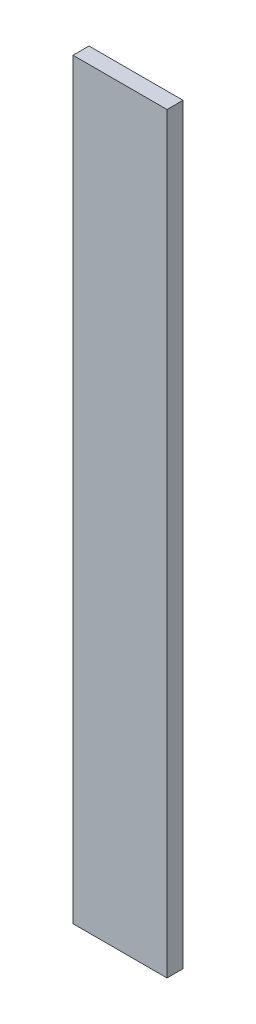
ISO-10303-21;
HEADER;
FILE_DESCRIPTION(('STEP AP214'),'2;1');
FILE_NAME('part.step','',(''),(''),'','','');
FILE_SCHEMA(('AUTOMOTIVE_DESIGN { 1 0 10303 214 1 1 1 1 }'));
ENDSEC;
DATA;
#1=APPLICATION_CONTEXT('core data for automotive mechanical design processes');
#2=APPLICATION_PROTOCOL_DEFINITION('international standard','automotive_design',2000,#1);
#3=PRODUCT_CONTEXT('',#1,'mechanical');
#4=PRODUCT('Part','Part','',(#3));
#5=PRODUCT_RELATED_PRODUCT_CATEGORY('part','',(#4));
#6=PRODUCT_DEFINITION_FORMATION('','',#4);
#7=PRODUCT_DEFINITION_CONTEXT('part definition',#1,'design');
#8=PRODUCT_DEFINITION('design','',#6,#7);
#9=PRODUCT_DEFINITION_SHAPE('','',#8);
#10=(LENGTH_UNIT() NAMED_UNIT(*) SI_UNIT(.MILLI.,.METRE.));
#11=(NAMED_UNIT(*) PLANE_ANGLE_UNIT() SI_UNIT($,.RADIAN.));
#12=(NAMED_UNIT(*) SI_UNIT($,.STERADIAN.) SOLID_ANGLE_UNIT());
#13=UNCERTAINTY_MEASURE_WITH_UNIT(LENGTH_MEASURE(1.E-05),#10,'distance_accuracy_value','');
#14=(GEOMETRIC_REPRESENTATION_CONTEXT(3) GLOBAL_UNCERTAINTY_ASSIGNED_CONTEXT((#13)) GLOBAL_UNIT_ASSIGNED_CONTEXT((#10,
#11,#12)) REPRESENTATION_CONTEXT('',''));
#15=CARTESIAN_POINT('',(0.,0.,0.));
#16=DIRECTION('',(0.,0.,1.));
#17=DIRECTION('',(1.,0.,0.));
#18=AXIS2_PLACEMENT_3D('',#15,#16,#17);
#19=CARTESIAN_POINT('',(1.27,10.16,0.4318));
#20=DIRECTION('',(0.,0.,-1.));
#21=DIRECTION('',(-1.,0.,0.));
#22=AXIS2_PLACEMENT_3D('',#19,#20,#21);
#23=PLANE('',#22);
#24=DIRECTION('',(0.,1.,0.));
#25=VECTOR('',#24,1.);
#26=CARTESIAN_POINT('',(-1.27,10.16,0.4318));
#27=LINE('',#26,#25);
#28=CARTESIAN_POINT('',(-1.27,10.16,0.4318));
#29=VERTEX_POINT('',#28);
#30=CARTESIAN_POINT('',(-1.27,-10.16,0.4318));
#31=VERTEX_POINT('',#30);
#32=EDGE_CURVE('E55',#29,#31,#27,.F.);
#33=ORIENTED_EDGE('',*,*,#32,.T.);
#34=DIRECTION('',(1.,0.,0.));
#35=VECTOR('',#34,1.);
#36=CARTESIAN_POINT('',(-1.27,-10.16,0.4318));
#37=LINE('',#36,#35);
#38=CARTESIAN_POINT('',(1.27,-10.16,0.4318));
#39=VERTEX_POINT('',#38);
#40=EDGE_CURVE('E57',#31,#39,#37,.T.);
#41=ORIENTED_EDGE('',*,*,#40,.T.);
#42=DIRECTION('',(0.,1.,0.));
#43=VECTOR('',#42,1.);
#44=CARTESIAN_POINT('',(1.27,-10.16,0.4318));
#45=LINE('',#44,#43);
#46=CARTESIAN_POINT('',(1.27,10.16,0.4318));
#47=VERTEX_POINT('',#46);
#48=EDGE_CURVE('E20',#39,#47,#45,.T.);
#49=ORIENTED_EDGE('',*,*,#48,.T.);
#50=DIRECTION('',(1.,0.,0.));
#51=VECTOR('',#50,1.);
#52=CARTESIAN_POINT('',(1.27,10.16,0.4318));
#53=LINE('',#52,#51);
#54=EDGE_CURVE('E80',#47,#29,#53,.F.);
#55=ORIENTED_EDGE('',*,*,#54,.T.);
#56=EDGE_LOOP('',(#33,#41,#49,#55));
#57=FACE_BOUND('',#56,.T.);
#58=ADVANCED_FACE('F17',(#57),#23,.F.);
#59=CARTESIAN_POINT('',(1.27,-10.16,0.));
#60=DIRECTION('',(-1.,0.,0.));
#61=DIRECTION('',(0.,0.,1.));
#62=AXIS2_PLACEMENT_3D('',#59,#60,#61);
#63=PLANE('',#62);
#64=DIRECTION('',(0.,0.,-1.));
#65=VECTOR('',#64,1.);
#66=CARTESIAN_POINT('',(1.27,10.16,0.));
#67=LINE('',#66,#65);
#68=CARTESIAN_POINT('',(1.27,10.16,0.));
#69=VERTEX_POINT('',#68);
#70=EDGE_CURVE('E68',#69,#47,#67,.F.);
#71=ORIENTED_EDGE('',*,*,#70,.T.);
#72=ORIENTED_EDGE('',*,*,#48,.F.);
#73=DIRECTION('',(0.,0.,1.));
#74=VECTOR('',#73,1.);
#75=CARTESIAN_POINT('',(1.27,-10.16,0.));
#76=LINE('',#75,#74);
#77=CARTESIAN_POINT('',(1.27,-10.16,0.));
#78=VERTEX_POINT('',#77);
#79=EDGE_CURVE('E63',#39,#78,#76,.F.);
#80=ORIENTED_EDGE('',*,*,#79,.T.);
#81=DIRECTION('',(0.,1.,0.));
#82=VECTOR('',#81,1.);
#83=CARTESIAN_POINT('',(1.27,10.16,0.));
#84=LINE('',#83,#82);
#85=EDGE_CURVE('E83',#69,#78,#84,.F.);
#86=ORIENTED_EDGE('',*,*,#85,.F.);
#87=EDGE_LOOP('',(#71,#72,#80,#86));
#88=FACE_BOUND('',#87,.T.);
#89=ADVANCED_FACE('F65',(#88),#63,.F.);
#90=CARTESIAN_POINT('',(-1.27,-10.16,0.));
#91=DIRECTION('',(0.,1.,0.));
#92=DIRECTION('',(0.,0.,1.));
#93=AXIS2_PLACEMENT_3D('',#90,#91,#92);
#94=PLANE('',#93);
#95=ORIENTED_EDGE('',*,*,#79,.F.);
#96=ORIENTED_EDGE('',*,*,#40,.F.);
#97=DIRECTION('',(0.,0.,-1.));
#98=VECTOR('',#97,1.);
#99=CARTESIAN_POINT('',(-1.27,-10.16,0.));
#100=LINE('',#99,#98);
#101=CARTESIAN_POINT('',(-1.27,-10.16,0.));
#102=VERTEX_POINT('',#101);
#103=EDGE_CURVE('E75',#31,#102,#100,.T.);
#104=ORIENTED_EDGE('',*,*,#103,.T.);
#105=DIRECTION('',(-1.,0.,0.));
#106=VECTOR('',#105,1.);
#107=CARTESIAN_POINT('',(1.27,-10.16,0.));
#108=LINE('',#107,#106);
#109=EDGE_CURVE('E72',#78,#102,#108,.T.);
#110=ORIENTED_EDGE('',*,*,#109,.F.);
#111=EDGE_LOOP('',(#95,#96,#104,#110));
#112=FACE_BOUND('',#111,.T.);
#113=ADVANCED_FACE('F70',(#112),#94,.F.);
#114=CARTESIAN_POINT('',(-1.27,10.16,0.));
#115=DIRECTION('',(1.,0.,0.));
#116=DIRECTION('',(0.,0.,-1.));
#117=AXIS2_PLACEMENT_3D('',#114,#115,#116);
#118=PLANE('',#117);
#119=ORIENTED_EDGE('',*,*,#103,.F.);
#120=ORIENTED_EDGE('',*,*,#32,.F.);
#121=DIRECTION('',(0.,0.,-1.));
#122=VECTOR('',#121,1.);
#123=CARTESIAN_POINT('',(-1.27,10.16,0.));
#124=LINE('',#123,#122);
#125=CARTESIAN_POINT('',(-1.27,10.16,0.));
#126=VERTEX_POINT('',#125);
#127=EDGE_CURVE('E35',#29,#126,#124,.T.);
#128=ORIENTED_EDGE('',*,*,#127,.T.);
#129=DIRECTION('',(0.,1.,0.));
#130=VECTOR('',#129,1.);
#131=CARTESIAN_POINT('',(-1.27,10.16,0.));
#132=LINE('',#131,#130);
#133=EDGE_CURVE('E26',#102,#126,#132,.T.);
#134=ORIENTED_EDGE('',*,*,#133,.F.);
#135=EDGE_LOOP('',(#119,#120,#128,#134));
#136=FACE_BOUND('',#135,.T.);
#137=ADVANCED_FACE('F89',(#136),#118,.F.);
#138=CARTESIAN_POINT('',(1.27,10.16,0.));
#139=DIRECTION('',(0.,-1.,0.));
#140=DIRECTION('',(0.,0.,-1.));
#141=AXIS2_PLACEMENT_3D('',#138,#139,#140);
#142=PLANE('',#141);
#143=ORIENTED_EDGE('',*,*,#127,.F.);
#144=ORIENTED_EDGE('',*,*,#54,.F.);
#145=ORIENTED_EDGE('',*,*,#70,.F.);
#146=DIRECTION('',(-1.,0.,0.));
#147=VECTOR('',#146,1.);
#148=CARTESIAN_POINT('',(1.27,10.16,0.));
#149=LINE('',#148,#147);
#150=EDGE_CURVE('E11',#126,#69,#149,.F.);
#151=ORIENTED_EDGE('',*,*,#150,.F.);
#152=EDGE_LOOP('',(#143,#144,#145,#151));
#153=FACE_BOUND('',#152,.T.);
#154=ADVANCED_FACE('F91',(#153),#142,.F.);
#155=CARTESIAN_POINT('',(1.27,10.16,0.));
#156=DIRECTION('',(0.,0.,-1.));
#157=DIRECTION('',(-1.,0.,0.));
#158=AXIS2_PLACEMENT_3D('',#155,#156,#157);
#159=PLANE('',#158);
#160=ORIENTED_EDGE('',*,*,#133,.T.);
#161=ORIENTED_EDGE('',*,*,#150,.T.);
#162=ORIENTED_EDGE('',*,*,#85,.T.);
#163=ORIENTED_EDGE('',*,*,#109,.T.);
#164=EDGE_LOOP('',(#160,#161,#162,#163));
#165=FACE_BOUND('',#164,.T.);
#166=ADVANCED_FACE('F88',(#165),#159,.T.);
#167=CLOSED_SHELL('',(#58,#89,#113,#137,#154,#166));
#168=MANIFOLD_SOLID_BREP('B1',#167);
#169=ADVANCED_BREP_SHAPE_REPRESENTATION('',(#18,#168),#14);
#170=SHAPE_DEFINITION_REPRESENTATION(#9,#169);
ENDSEC;
END-ISO-10303-21;
